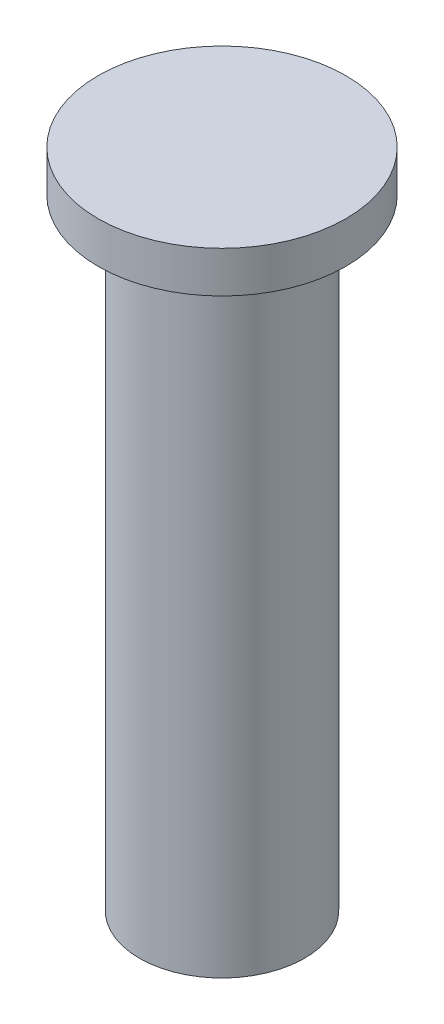
ISO-10303-21;
HEADER;
FILE_DESCRIPTION(('STEP AP214'),'2;1');
FILE_NAME('part.step','',(''),(''),'','','');
FILE_SCHEMA(('AUTOMOTIVE_DESIGN { 1 0 10303 214 1 1 1 1 }'));
ENDSEC;
DATA;
#1=APPLICATION_CONTEXT('core data for automotive mechanical design processes');
#2=APPLICATION_PROTOCOL_DEFINITION('international standard','automotive_design',2000,#1);
#3=PRODUCT_CONTEXT('',#1,'mechanical');
#4=PRODUCT('Part','Part','',(#3));
#5=PRODUCT_RELATED_PRODUCT_CATEGORY('part','',(#4));
#6=PRODUCT_DEFINITION_FORMATION('','',#4);
#7=PRODUCT_DEFINITION_CONTEXT('part definition',#1,'design');
#8=PRODUCT_DEFINITION('design','',#6,#7);
#9=PRODUCT_DEFINITION_SHAPE('','',#8);
#10=(LENGTH_UNIT() NAMED_UNIT(*) SI_UNIT(.MILLI.,.METRE.));
#11=(NAMED_UNIT(*) PLANE_ANGLE_UNIT() SI_UNIT($,.RADIAN.));
#12=(NAMED_UNIT(*) SI_UNIT($,.STERADIAN.) SOLID_ANGLE_UNIT());
#13=UNCERTAINTY_MEASURE_WITH_UNIT(LENGTH_MEASURE(1.E-05),#10,'distance_accuracy_value','');
#14=(GEOMETRIC_REPRESENTATION_CONTEXT(3) GLOBAL_UNCERTAINTY_ASSIGNED_CONTEXT((#13)) GLOBAL_UNIT_ASSIGNED_CONTEXT((#10,
#11,#12)) REPRESENTATION_CONTEXT('',''));
#15=CARTESIAN_POINT('',(0.,0.,0.));
#16=DIRECTION('',(0.,0.,1.));
#17=DIRECTION('',(1.,0.,0.));
#18=AXIS2_PLACEMENT_3D('',#15,#16,#17);
#19=CARTESIAN_POINT('',(0.,38.1,0.));
#20=DIRECTION('',(0.,-1.,0.));
#21=DIRECTION('',(0.,0.,-1.));
#22=AXIS2_PLACEMENT_3D('',#19,#20,#21);
#23=CYLINDRICAL_SURFACE('',#22,5.075);
#24=CARTESIAN_POINT('',(0.,38.1,0.));
#25=DIRECTION('',(0.,1.,0.));
#26=DIRECTION('',(0.,0.,1.));
#27=AXIS2_PLACEMENT_3D('',#24,#25,#26);
#28=CIRCLE('',#27,5.075);
#29=CARTESIAN_POINT('',(0.,38.1,5.075));
#30=VERTEX_POINT('',#29);
#31=EDGE_CURVE('E10',#30,#30,#28,.T.);
#32=ORIENTED_EDGE('',*,*,#31,.F.);
#33=EDGE_LOOP('',(#32));
#34=FACE_BOUND('',#33,.T.);
#35=CARTESIAN_POINT('',(0.,0.,0.));
#36=DIRECTION('',(0.,1.,0.));
#37=DIRECTION('',(0.,0.,1.));
#38=AXIS2_PLACEMENT_3D('',#35,#36,#37);
#39=CIRCLE('',#38,5.075);
#40=CARTESIAN_POINT('',(0.,0.,5.075));
#41=VERTEX_POINT('',#40);
#42=EDGE_CURVE('E38',#41,#41,#39,.T.);
#43=ORIENTED_EDGE('',*,*,#42,.T.);
#44=EDGE_LOOP('',(#43));
#45=FACE_BOUND('',#44,.T.);
#46=ADVANCED_FACE('F35',(#34,#45),#23,.T.);
#47=CARTESIAN_POINT('',(0.,0.,0.));
#48=DIRECTION('',(0.,1.,0.));
#49=DIRECTION('',(0.,0.,1.));
#50=AXIS2_PLACEMENT_3D('',#47,#48,#49);
#51=PLANE('',#50);
#52=ORIENTED_EDGE('',*,*,#42,.F.);
#53=EDGE_LOOP('',(#52));
#54=FACE_BOUND('',#53,.T.);
#55=ADVANCED_FACE('F58',(#54),#51,.F.);
#56=CARTESIAN_POINT('',(0.,40.64,0.));
#57=DIRECTION('',(0.,-1.,0.));
#58=DIRECTION('',(0.,0.,-1.));
#59=AXIS2_PLACEMENT_3D('',#56,#57,#58);
#60=CYLINDRICAL_SURFACE('',#59,7.615);
#61=CARTESIAN_POINT('',(0.,40.64,0.));
#62=DIRECTION('',(0.,1.,0.));
#63=DIRECTION('',(0.,0.,1.));
#64=AXIS2_PLACEMENT_3D('',#61,#62,#63);
#65=CIRCLE('',#64,7.615);
#66=CARTESIAN_POINT('',(0.,40.64,7.615));
#67=VERTEX_POINT('',#66);
#68=EDGE_CURVE('E45',#67,#67,#65,.T.);
#69=ORIENTED_EDGE('',*,*,#68,.F.);
#70=EDGE_LOOP('',(#69));
#71=FACE_BOUND('',#70,.T.);
#72=CARTESIAN_POINT('',(0.,38.1,0.));
#73=DIRECTION('',(0.,1.,0.));
#74=DIRECTION('',(0.,0.,1.));
#75=AXIS2_PLACEMENT_3D('',#72,#73,#74);
#76=CIRCLE('',#75,7.615);
#77=CARTESIAN_POINT('',(0.,38.1,7.615));
#78=VERTEX_POINT('',#77);
#79=EDGE_CURVE('E47',#78,#78,#76,.T.);
#80=ORIENTED_EDGE('',*,*,#79,.T.);
#81=EDGE_LOOP('',(#80));
#82=FACE_BOUND('',#81,.T.);
#83=ADVANCED_FACE('F55',(#71,#82),#60,.T.);
#84=CARTESIAN_POINT('',(0.,40.64,0.));
#85=DIRECTION('',(0.,1.,0.));
#86=DIRECTION('',(0.,0.,1.));
#87=AXIS2_PLACEMENT_3D('',#84,#85,#86);
#88=PLANE('',#87);
#89=ORIENTED_EDGE('',*,*,#68,.T.);
#90=EDGE_LOOP('',(#89));
#91=FACE_BOUND('',#90,.T.);
#92=ADVANCED_FACE('F53',(#91),#88,.T.);
#93=CARTESIAN_POINT('',(0.,38.1,0.));
#94=DIRECTION('',(0.,1.,0.));
#95=DIRECTION('',(0.,0.,1.));
#96=AXIS2_PLACEMENT_3D('',#93,#94,#95);
#97=PLANE('',#96);
#98=ORIENTED_EDGE('',*,*,#31,.T.);
#99=EDGE_LOOP('',(#98));
#100=FACE_BOUND('',#99,.T.);
#101=ORIENTED_EDGE('',*,*,#79,.F.);
#102=EDGE_LOOP('',(#101));
#103=FACE_BOUND('',#102,.T.);
#104=ADVANCED_FACE('F62',(#100,#103),#97,.F.);
#105=CLOSED_SHELL('',(#46,#55,#83,#92,#104));
#106=MANIFOLD_SOLID_BREP('B2',#105);
#107=ADVANCED_BREP_SHAPE_REPRESENTATION('',(#18,#106),#14);
#108=SHAPE_DEFINITION_REPRESENTATION(#9,#107);
ENDSEC;
END-ISO-10303-21;
